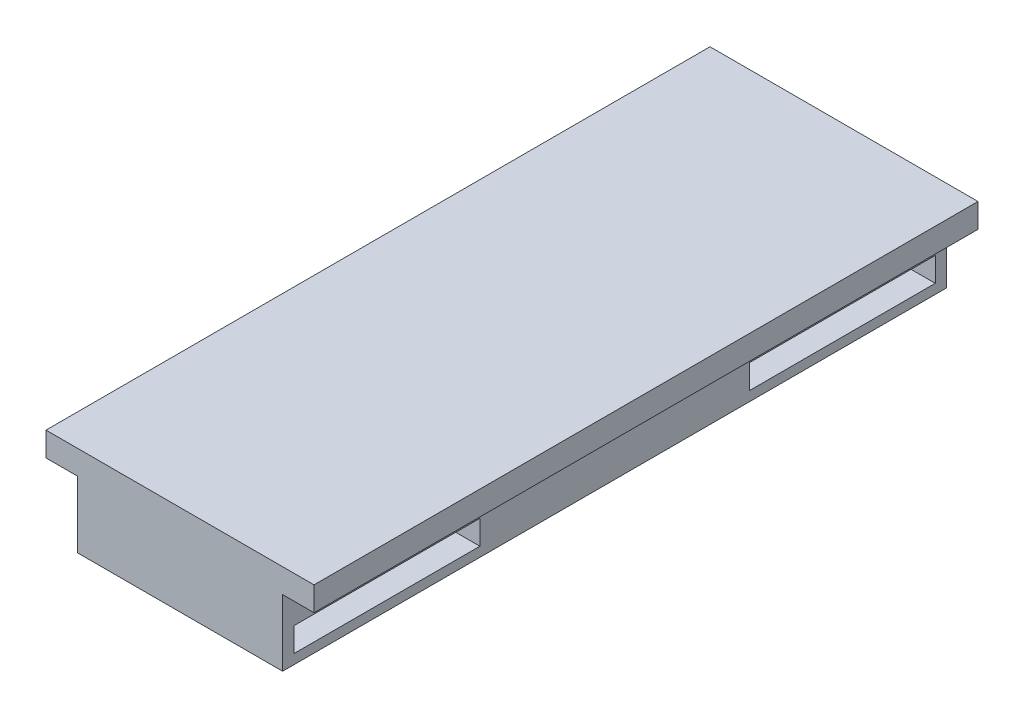
ISO-10303-21;
HEADER;
FILE_DESCRIPTION(('STEP AP214'),'2;1');
FILE_NAME('part.step','',(''),(''),'','','');
FILE_SCHEMA(('AUTOMOTIVE_DESIGN { 1 0 10303 214 1 1 1 1 }'));
ENDSEC;
DATA;
#1=APPLICATION_CONTEXT('core data for automotive mechanical design processes');
#2=APPLICATION_PROTOCOL_DEFINITION('international standard','automotive_design',2000,#1);
#3=PRODUCT_CONTEXT('',#1,'mechanical');
#4=PRODUCT('Part','Part','',(#3));
#5=PRODUCT_RELATED_PRODUCT_CATEGORY('part','',(#4));
#6=PRODUCT_DEFINITION_FORMATION('','',#4);
#7=PRODUCT_DEFINITION_CONTEXT('part definition',#1,'design');
#8=PRODUCT_DEFINITION('design','',#6,#7);
#9=PRODUCT_DEFINITION_SHAPE('','',#8);
#10=(LENGTH_UNIT() NAMED_UNIT(*) SI_UNIT(.MILLI.,.METRE.));
#11=(NAMED_UNIT(*) PLANE_ANGLE_UNIT() SI_UNIT($,.RADIAN.));
#12=(NAMED_UNIT(*) SI_UNIT($,.STERADIAN.) SOLID_ANGLE_UNIT());
#13=UNCERTAINTY_MEASURE_WITH_UNIT(LENGTH_MEASURE(1.E-05),#10,'distance_accuracy_value','');
#14=(GEOMETRIC_REPRESENTATION_CONTEXT(3) GLOBAL_UNCERTAINTY_ASSIGNED_CONTEXT((#13)) GLOBAL_UNIT_ASSIGNED_CONTEXT((#10,
#11,#12)) REPRESENTATION_CONTEXT('',''));
#15=CARTESIAN_POINT('',(0.,0.,0.));
#16=DIRECTION('',(0.,0.,1.));
#17=DIRECTION('',(1.,0.,0.));
#18=AXIS2_PLACEMENT_3D('',#15,#16,#17);
#19=CARTESIAN_POINT('',(11.1,0.519205922994457,-8.64));
#20=DIRECTION('',(0.,-1.,0.));
#21=DIRECTION('',(0.,0.,-1.));
#22=AXIS2_PLACEMENT_3D('',#19,#20,#21);
#23=CYLINDRICAL_SURFACE('',#22,7.7);
#24=DIRECTION('',(0.,-1.,0.));
#25=VECTOR('',#24,1.);
#26=CARTESIAN_POINT('',(11.1,0.519205922994459,-0.940000000000003));
#27=LINE('',#26,#25);
#28=CARTESIAN_POINT('',(11.1,0.519205922994459,-0.940000000000003));
#29=VERTEX_POINT('',#28);
#30=CARTESIAN_POINT('',(11.1,-1.48079407700554,-0.940000000000003));
#31=VERTEX_POINT('',#30);
#32=EDGE_CURVE('E154',#29,#31,#27,.T.);
#33=ORIENTED_EDGE('',*,*,#32,.T.);
#34=CARTESIAN_POINT('',(11.1,-1.48079407700554,-8.64));
#35=DIRECTION('',(0.,-1.,0.));
#36=DIRECTION('',(0.,0.,-1.));
#37=AXIS2_PLACEMENT_3D('',#34,#35,#36);
#38=CIRCLE('',#37,7.7);
#39=CARTESIAN_POINT('',(11.1,-1.48079407700554,-16.34));
#40=VERTEX_POINT('',#39);
#41=EDGE_CURVE('E48',#40,#31,#38,.F.);
#42=ORIENTED_EDGE('',*,*,#41,.F.);
#43=DIRECTION('',(0.,1.,0.));
#44=VECTOR('',#43,1.);
#45=CARTESIAN_POINT('',(11.1,0.519205922994459,-16.34));
#46=LINE('',#45,#44);
#47=CARTESIAN_POINT('',(11.1,0.519205922994457,-16.34));
#48=VERTEX_POINT('',#47);
#49=EDGE_CURVE('E162',#40,#48,#46,.T.);
#50=ORIENTED_EDGE('',*,*,#49,.T.);
#51=CARTESIAN_POINT('',(11.1,0.519205922994457,-8.64));
#52=DIRECTION('',(0.,-1.,0.));
#53=DIRECTION('',(0.,0.,-1.));
#54=AXIS2_PLACEMENT_3D('',#51,#52,#53);
#55=CIRCLE('',#54,7.7);
#56=EDGE_CURVE('E168',#29,#48,#55,.T.);
#57=ORIENTED_EDGE('',*,*,#56,.F.);
#58=EDGE_LOOP('',(#33,#42,#50,#57));
#59=FACE_BOUND('',#58,.T.);
#60=ADVANCED_FACE('F39',(#59),#23,.F.);
#61=CARTESIAN_POINT('',(11.1,0.519205922994457,-46.36));
#62=DIRECTION('',(0.,-1.,0.));
#63=DIRECTION('',(0.,0.,-1.));
#64=AXIS2_PLACEMENT_3D('',#61,#62,#63);
#65=CYLINDRICAL_SURFACE('',#64,7.7);
#66=DIRECTION('',(0.,-1.,0.));
#67=VECTOR('',#66,1.);
#68=CARTESIAN_POINT('',(11.1,0.519205922994459,-38.66));
#69=LINE('',#68,#67);
#70=CARTESIAN_POINT('',(11.1,0.519205922994459,-38.66));
#71=VERTEX_POINT('',#70);
#72=CARTESIAN_POINT('',(11.1,-1.48079407700554,-38.66));
#73=VERTEX_POINT('',#72);
#74=EDGE_CURVE('E304',#71,#73,#69,.T.);
#75=ORIENTED_EDGE('',*,*,#74,.T.);
#76=CARTESIAN_POINT('',(11.1,-1.48079407700554,-46.36));
#77=DIRECTION('',(0.,-1.,0.));
#78=DIRECTION('',(0.,0.,-1.));
#79=AXIS2_PLACEMENT_3D('',#76,#77,#78);
#80=CIRCLE('',#79,7.7);
#81=CARTESIAN_POINT('',(11.1,-1.48079407700554,-54.06));
#82=VERTEX_POINT('',#81);
#83=EDGE_CURVE('E11',#82,#73,#80,.F.);
#84=ORIENTED_EDGE('',*,*,#83,.F.);
#85=DIRECTION('',(0.,1.,0.));
#86=VECTOR('',#85,1.);
#87=CARTESIAN_POINT('',(11.1,0.519205922994459,-54.06));
#88=LINE('',#87,#86);
#89=CARTESIAN_POINT('',(11.1,0.519205922994457,-54.06));
#90=VERTEX_POINT('',#89);
#91=EDGE_CURVE('E291',#82,#90,#88,.T.);
#92=ORIENTED_EDGE('',*,*,#91,.T.);
#93=CARTESIAN_POINT('',(11.1,0.519205922994457,-46.36));
#94=DIRECTION('',(0.,-1.,0.));
#95=DIRECTION('',(0.,0.,-1.));
#96=AXIS2_PLACEMENT_3D('',#93,#94,#95);
#97=CIRCLE('',#96,7.7);
#98=EDGE_CURVE('E264',#71,#90,#97,.T.);
#99=ORIENTED_EDGE('',*,*,#98,.F.);
#100=EDGE_LOOP('',(#75,#84,#92,#99));
#101=FACE_BOUND('',#100,.T.);
#102=ADVANCED_FACE('F358',(#101),#65,.F.);
#103=CARTESIAN_POINT('',(2.6,-2.28079407700554,-55.));
#104=DIRECTION('',(-1.,0.,0.));
#105=DIRECTION('',(0.,-1.,0.));
#106=AXIS2_PLACEMENT_3D('',#103,#104,#105);
#107=PLANE('',#106);
#108=DIRECTION('',(0.,-1.,0.));
#109=VECTOR('',#108,1.);
#110=CARTESIAN_POINT('',(2.6,-2.28079407700554,0.));
#111=LINE('',#110,#109);
#112=CARTESIAN_POINT('',(2.6,3.21920592299446,0.));
#113=VERTEX_POINT('',#112);
#114=CARTESIAN_POINT('',(2.6,-2.28079407700554,0.));
#115=VERTEX_POINT('',#114);
#116=EDGE_CURVE('E230',#113,#115,#111,.T.);
#117=ORIENTED_EDGE('',*,*,#116,.F.);
#118=DIRECTION('',(0.,0.,1.));
#119=VECTOR('',#118,1.);
#120=CARTESIAN_POINT('',(2.6,3.21920592299446,-55.));
#121=LINE('',#120,#119);
#122=CARTESIAN_POINT('',(2.6,3.21920592299446,-55.));
#123=VERTEX_POINT('',#122);
#124=EDGE_CURVE('E175',#123,#113,#121,.T.);
#125=ORIENTED_EDGE('',*,*,#124,.F.);
#126=DIRECTION('',(0.,-1.,0.));
#127=VECTOR('',#126,1.);
#128=CARTESIAN_POINT('',(2.6,-2.28079407700554,-55.));
#129=LINE('',#128,#127);
#130=CARTESIAN_POINT('',(2.6,-2.28079407700554,-55.));
#131=VERTEX_POINT('',#130);
#132=EDGE_CURVE('E205',#123,#131,#129,.T.);
#133=ORIENTED_EDGE('',*,*,#132,.T.);
#134=DIRECTION('',(0.,0.,1.));
#135=VECTOR('',#134,1.);
#136=CARTESIAN_POINT('',(2.6,-2.28079407700554,-55.));
#137=LINE('',#136,#135);
#138=EDGE_CURVE('E180',#131,#115,#137,.T.);
#139=ORIENTED_EDGE('',*,*,#138,.T.);
#140=EDGE_LOOP('',(#117,#125,#133,#139));
#141=FACE_BOUND('',#140,.T.);
#142=ADVANCED_FACE('F41',(#141),#107,.T.);
#143=CARTESIAN_POINT('',(2.6,3.21920592299446,-55.));
#144=DIRECTION('',(0.,-1.,0.));
#145=DIRECTION('',(1.,0.,0.));
#146=AXIS2_PLACEMENT_3D('',#143,#144,#145);
#147=PLANE('',#146);
#148=DIRECTION('',(1.,0.,0.));
#149=VECTOR('',#148,1.);
#150=CARTESIAN_POINT('',(2.6,3.21920592299446,0.));
#151=LINE('',#150,#149);
#152=CARTESIAN_POINT('',(0.,3.21920592299446,0.));
#153=VERTEX_POINT('',#152);
#154=EDGE_CURVE('E201',#153,#113,#151,.T.);
#155=ORIENTED_EDGE('',*,*,#154,.F.);
#156=DIRECTION('',(0.,0.,1.));
#157=VECTOR('',#156,1.);
#158=CARTESIAN_POINT('',(0.,3.21920592299446,-55.));
#159=LINE('',#158,#157);
#160=CARTESIAN_POINT('',(0.,3.21920592299446,-55.));
#161=VERTEX_POINT('',#160);
#162=EDGE_CURVE('E177',#161,#153,#159,.T.);
#163=ORIENTED_EDGE('',*,*,#162,.F.);
#164=DIRECTION('',(1.,0.,0.));
#165=VECTOR('',#164,1.);
#166=CARTESIAN_POINT('',(2.6,3.21920592299446,-55.));
#167=LINE('',#166,#165);
#168=EDGE_CURVE('E184',#161,#123,#167,.T.);
#169=ORIENTED_EDGE('',*,*,#168,.T.);
#170=ORIENTED_EDGE('',*,*,#124,.T.);
#171=EDGE_LOOP('',(#155,#163,#169,#170));
#172=FACE_BOUND('',#171,.T.);
#173=ADVANCED_FACE('F383',(#172),#147,.T.);
#174=CARTESIAN_POINT('',(0.,3.21920592299446,-55.));
#175=DIRECTION('',(-1.,0.,0.));
#176=DIRECTION('',(0.,0.,1.));
#177=AXIS2_PLACEMENT_3D('',#174,#175,#176);
#178=PLANE('',#177);
#179=DIRECTION('',(0.,-1.,0.));
#180=VECTOR('',#179,1.);
#181=CARTESIAN_POINT('',(0.,3.21920592299446,0.));
#182=LINE('',#181,#180);
#183=CARTESIAN_POINT('',(0.,5.21920592299446,0.));
#184=VERTEX_POINT('',#183);
#185=EDGE_CURVE('E206',#184,#153,#182,.T.);
#186=ORIENTED_EDGE('',*,*,#185,.F.);
#187=DIRECTION('',(0.,0.,1.));
#188=VECTOR('',#187,1.);
#189=CARTESIAN_POINT('',(0.,5.21920592299446,-55.));
#190=LINE('',#189,#188);
#191=CARTESIAN_POINT('',(0.,5.21920592299446,-55.));
#192=VERTEX_POINT('',#191);
#193=EDGE_CURVE('E196',#192,#184,#190,.T.);
#194=ORIENTED_EDGE('',*,*,#193,.F.);
#195=DIRECTION('',(0.,-1.,0.));
#196=VECTOR('',#195,1.);
#197=CARTESIAN_POINT('',(0.,3.21920592299446,-55.));
#198=LINE('',#197,#196);
#199=EDGE_CURVE('E237',#192,#161,#198,.T.);
#200=ORIENTED_EDGE('',*,*,#199,.T.);
#201=ORIENTED_EDGE('',*,*,#162,.T.);
#202=EDGE_LOOP('',(#186,#194,#200,#201));
#203=FACE_BOUND('',#202,.T.);
#204=ADVANCED_FACE('F386',(#203),#178,.T.);
#205=CARTESIAN_POINT('',(0.,5.21920592299446,-55.));
#206=DIRECTION('',(0.,1.,0.));
#207=DIRECTION('',(-1.,0.,0.));
#208=AXIS2_PLACEMENT_3D('',#205,#206,#207);
#209=PLANE('',#208);
#210=DIRECTION('',(-1.,0.,0.));
#211=VECTOR('',#210,1.);
#212=CARTESIAN_POINT('',(0.,5.21920592299446,0.));
#213=LINE('',#212,#211);
#214=CARTESIAN_POINT('',(22.2,5.21920592299446,0.));
#215=VERTEX_POINT('',#214);
#216=EDGE_CURVE('E210',#215,#184,#213,.T.);
#217=ORIENTED_EDGE('',*,*,#216,.F.);
#218=DIRECTION('',(0.,0.,1.));
#219=VECTOR('',#218,1.);
#220=CARTESIAN_POINT('',(22.2,5.21920592299446,-55.));
#221=LINE('',#220,#219);
#222=CARTESIAN_POINT('',(22.2,5.21920592299446,-55.));
#223=VERTEX_POINT('',#222);
#224=EDGE_CURVE('E193',#223,#215,#221,.T.);
#225=ORIENTED_EDGE('',*,*,#224,.F.);
#226=DIRECTION('',(-1.,0.,0.));
#227=VECTOR('',#226,1.);
#228=CARTESIAN_POINT('',(0.,5.21920592299446,-55.));
#229=LINE('',#228,#227);
#230=EDGE_CURVE('E241',#223,#192,#229,.T.);
#231=ORIENTED_EDGE('',*,*,#230,.T.);
#232=ORIENTED_EDGE('',*,*,#193,.T.);
#233=EDGE_LOOP('',(#217,#225,#231,#232));
#234=FACE_BOUND('',#233,.T.);
#235=ADVANCED_FACE('F390',(#234),#209,.T.);
#236=CARTESIAN_POINT('',(22.2,5.21920592299446,-55.));
#237=DIRECTION('',(1.,0.,0.));
#238=DIRECTION('',(0.,0.,-1.));
#239=AXIS2_PLACEMENT_3D('',#236,#237,#238);
#240=PLANE('',#239);
#241=DIRECTION('',(0.,1.,0.));
#242=VECTOR('',#241,1.);
#243=CARTESIAN_POINT('',(22.2,5.21920592299446,0.));
#244=LINE('',#243,#242);
#245=CARTESIAN_POINT('',(22.2,3.21920592299446,0.));
#246=VERTEX_POINT('',#245);
#247=EDGE_CURVE('E214',#246,#215,#244,.T.);
#248=ORIENTED_EDGE('',*,*,#247,.F.);
#249=DIRECTION('',(0.,0.,1.));
#250=VECTOR('',#249,1.);
#251=CARTESIAN_POINT('',(22.2,3.21920592299446,-55.));
#252=LINE('',#251,#250);
#253=CARTESIAN_POINT('',(22.2,3.21920592299446,-55.));
#254=VERTEX_POINT('',#253);
#255=EDGE_CURVE('E190',#254,#246,#252,.T.);
#256=ORIENTED_EDGE('',*,*,#255,.F.);
#257=DIRECTION('',(0.,1.,0.));
#258=VECTOR('',#257,1.);
#259=CARTESIAN_POINT('',(22.2,5.21920592299446,-55.));
#260=LINE('',#259,#258);
#261=EDGE_CURVE('E245',#254,#223,#260,.T.);
#262=ORIENTED_EDGE('',*,*,#261,.T.);
#263=ORIENTED_EDGE('',*,*,#224,.T.);
#264=EDGE_LOOP('',(#248,#256,#262,#263));
#265=FACE_BOUND('',#264,.T.);
#266=ADVANCED_FACE('F394',(#265),#240,.T.);
#267=CARTESIAN_POINT('',(22.2,3.21920592299446,-55.));
#268=DIRECTION('',(0.,-1.,0.));
#269=DIRECTION('',(1.,0.,0.));
#270=AXIS2_PLACEMENT_3D('',#267,#268,#269);
#271=PLANE('',#270);
#272=DIRECTION('',(1.,0.,0.));
#273=VECTOR('',#272,1.);
#274=CARTESIAN_POINT('',(22.2,3.21920592299446,0.));
#275=LINE('',#274,#273);
#276=CARTESIAN_POINT('',(19.6,3.21920592299446,0.));
#277=VERTEX_POINT('',#276);
#278=EDGE_CURVE('E218',#277,#246,#275,.T.);
#279=ORIENTED_EDGE('',*,*,#278,.F.);
#280=DIRECTION('',(0.,0.,1.));
#281=VECTOR('',#280,1.);
#282=CARTESIAN_POINT('',(19.6,3.21920592299446,-55.));
#283=LINE('',#282,#281);
#284=CARTESIAN_POINT('',(19.6,3.21920592299446,-55.));
#285=VERTEX_POINT('',#284);
#286=EDGE_CURVE('E187',#285,#277,#283,.T.);
#287=ORIENTED_EDGE('',*,*,#286,.F.);
#288=DIRECTION('',(1.,0.,0.));
#289=VECTOR('',#288,1.);
#290=CARTESIAN_POINT('',(22.2,3.21920592299446,-55.));
#291=LINE('',#290,#289);
#292=EDGE_CURVE('E249',#285,#254,#291,.T.);
#293=ORIENTED_EDGE('',*,*,#292,.T.);
#294=ORIENTED_EDGE('',*,*,#255,.T.);
#295=EDGE_LOOP('',(#279,#287,#293,#294));
#296=FACE_BOUND('',#295,.T.);
#297=ADVANCED_FACE('F398',(#296),#271,.T.);
#298=CARTESIAN_POINT('',(19.6,-2.28079407700554,-55.));
#299=DIRECTION('',(1.,0.,0.));
#300=DIRECTION('',(0.,0.,-1.));
#301=AXIS2_PLACEMENT_3D('',#298,#299,#300);
#302=PLANE('',#301);
#303=DIRECTION('',(0.,-1.,0.));
#304=VECTOR('',#303,1.);
#305=CARTESIAN_POINT('',(19.6,0.519205922994459,-0.940000000000003));
#306=LINE('',#305,#304);
#307=CARTESIAN_POINT('',(19.6,0.519205922994459,-0.940000000000003));
#308=VERTEX_POINT('',#307);
#309=CARTESIAN_POINT('',(19.6,-1.48079407700554,-0.940000000000003));
#310=VERTEX_POINT('',#309);
#311=EDGE_CURVE('E55',#308,#310,#306,.T.);
#312=ORIENTED_EDGE('',*,*,#311,.F.);
#313=DIRECTION('',(0.,0.,1.));
#314=VECTOR('',#313,1.);
#315=CARTESIAN_POINT('',(19.6,0.519205922994459,-0.940000000000003));
#316=LINE('',#315,#314);
#317=CARTESIAN_POINT('',(19.6,0.519205922994459,-16.34));
#318=VERTEX_POINT('',#317);
#319=EDGE_CURVE('E170',#318,#308,#316,.T.);
#320=ORIENTED_EDGE('',*,*,#319,.F.);
#321=DIRECTION('',(0.,1.,0.));
#322=VECTOR('',#321,1.);
#323=CARTESIAN_POINT('',(19.6,0.519205922994459,-16.34));
#324=LINE('',#323,#322);
#325=CARTESIAN_POINT('',(19.6,-1.48079407700554,-16.34));
#326=VERTEX_POINT('',#325);
#327=EDGE_CURVE('E331',#326,#318,#324,.T.);
#328=ORIENTED_EDGE('',*,*,#327,.F.);
#329=DIRECTION('',(0.,0.,-1.));
#330=VECTOR('',#329,1.);
#331=CARTESIAN_POINT('',(19.6,-1.48079407700554,-0.940000000000003));
#332=LINE('',#331,#330);
#333=EDGE_CURVE('E335',#310,#326,#332,.T.);
#334=ORIENTED_EDGE('',*,*,#333,.F.);
#335=EDGE_LOOP('',(#312,#320,#328,#334));
#336=FACE_BOUND('',#335,.T.);
#337=DIRECTION('',(0.,-1.,0.));
#338=VECTOR('',#337,1.);
#339=CARTESIAN_POINT('',(19.6,0.519205922994459,-38.66));
#340=LINE('',#339,#338);
#341=CARTESIAN_POINT('',(19.6,0.519205922994459,-38.66));
#342=VERTEX_POINT('',#341);
#343=CARTESIAN_POINT('',(19.6,-1.48079407700554,-38.66));
#344=VERTEX_POINT('',#343);
#345=EDGE_CURVE('E63',#342,#344,#340,.T.);
#346=ORIENTED_EDGE('',*,*,#345,.F.);
#347=DIRECTION('',(0.,0.,1.));
#348=VECTOR('',#347,1.);
#349=CARTESIAN_POINT('',(19.6,0.519205922994459,-38.66));
#350=LINE('',#349,#348);
#351=CARTESIAN_POINT('',(19.6,0.519205922994459,-54.06));
#352=VERTEX_POINT('',#351);
#353=EDGE_CURVE('E300',#352,#342,#350,.T.);
#354=ORIENTED_EDGE('',*,*,#353,.F.);
#355=DIRECTION('',(0.,1.,0.));
#356=VECTOR('',#355,1.);
#357=CARTESIAN_POINT('',(19.6,0.519205922994459,-54.06));
#358=LINE('',#357,#356);
#359=CARTESIAN_POINT('',(19.6,-1.48079407700554,-54.06));
#360=VERTEX_POINT('',#359);
#361=EDGE_CURVE('E305',#360,#352,#358,.T.);
#362=ORIENTED_EDGE('',*,*,#361,.F.);
#363=DIRECTION('',(0.,0.,-1.));
#364=VECTOR('',#363,1.);
#365=CARTESIAN_POINT('',(19.6,-1.48079407700554,-38.66));
#366=LINE('',#365,#364);
#367=EDGE_CURVE('E309',#344,#360,#366,.T.);
#368=ORIENTED_EDGE('',*,*,#367,.F.);
#369=EDGE_LOOP('',(#346,#354,#362,#368));
#370=FACE_BOUND('',#369,.T.);
#371=DIRECTION('',(0.,1.,0.));
#372=VECTOR('',#371,1.);
#373=CARTESIAN_POINT('',(19.6,-2.28079407700554,0.));
#374=LINE('',#373,#372);
#375=CARTESIAN_POINT('',(19.6,-2.28079407700554,0.));
#376=VERTEX_POINT('',#375);
#377=EDGE_CURVE('E222',#376,#277,#374,.T.);
#378=ORIENTED_EDGE('',*,*,#377,.F.);
#379=DIRECTION('',(0.,0.,1.));
#380=VECTOR('',#379,1.);
#381=CARTESIAN_POINT('',(19.6,-2.28079407700554,-55.));
#382=LINE('',#381,#380);
#383=CARTESIAN_POINT('',(19.6,-2.28079407700554,-55.));
#384=VERTEX_POINT('',#383);
#385=EDGE_CURVE('E183',#384,#376,#382,.T.);
#386=ORIENTED_EDGE('',*,*,#385,.F.);
#387=DIRECTION('',(0.,1.,0.));
#388=VECTOR('',#387,1.);
#389=CARTESIAN_POINT('',(19.6,-2.28079407700554,-55.));
#390=LINE('',#389,#388);
#391=EDGE_CURVE('E253',#384,#285,#390,.T.);
#392=ORIENTED_EDGE('',*,*,#391,.T.);
#393=ORIENTED_EDGE('',*,*,#286,.T.);
#394=EDGE_LOOP('',(#378,#386,#392,#393));
#395=FACE_BOUND('',#394,.T.);
#396=ADVANCED_FACE('F347',(#336,#370,#395),#302,.T.);
#397=CARTESIAN_POINT('',(2.6,-2.28079407700554,-55.));
#398=DIRECTION('',(0.,-1.,0.));
#399=DIRECTION('',(1.,0.,0.));
#400=AXIS2_PLACEMENT_3D('',#397,#398,#399);
#401=PLANE('',#400);
#402=DIRECTION('',(1.,0.,0.));
#403=VECTOR('',#402,1.);
#404=CARTESIAN_POINT('',(2.6,-2.28079407700554,0.));
#405=LINE('',#404,#403);
#406=EDGE_CURVE('E226',#115,#376,#405,.T.);
#407=ORIENTED_EDGE('',*,*,#406,.F.);
#408=ORIENTED_EDGE('',*,*,#138,.F.);
#409=DIRECTION('',(1.,0.,0.));
#410=VECTOR('',#409,1.);
#411=CARTESIAN_POINT('',(2.6,-2.28079407700554,-55.));
#412=LINE('',#411,#410);
#413=EDGE_CURVE('E257',#131,#384,#412,.T.);
#414=ORIENTED_EDGE('',*,*,#413,.T.);
#415=ORIENTED_EDGE('',*,*,#385,.T.);
#416=EDGE_LOOP('',(#407,#408,#414,#415));
#417=FACE_BOUND('',#416,.T.);
#418=CARTESIAN_POINT('',(11.1,-2.28079407700554,-8.64));
#419=DIRECTION('',(0.,-1.,0.));
#420=DIRECTION('',(0.,0.,-1.));
#421=AXIS2_PLACEMENT_3D('',#418,#419,#420);
#422=CIRCLE('',#421,5.5);
#423=CARTESIAN_POINT('',(11.1,-2.28079407700554,-14.14));
#424=VERTEX_POINT('',#423);
#425=EDGE_CURVE('E271',#424,#424,#422,.T.);
#426=ORIENTED_EDGE('',*,*,#425,.F.);
#427=EDGE_LOOP('',(#426));
#428=FACE_BOUND('',#427,.T.);
#429=CARTESIAN_POINT('',(11.1,-2.28079407700554,-46.36));
#430=DIRECTION('',(0.,-1.,0.));
#431=DIRECTION('',(0.,0.,-1.));
#432=AXIS2_PLACEMENT_3D('',#429,#430,#431);
#433=CIRCLE('',#432,5.5);
#434=CARTESIAN_POINT('',(11.1,-2.28079407700554,-51.86));
#435=VERTEX_POINT('',#434);
#436=EDGE_CURVE('E279',#435,#435,#433,.T.);
#437=ORIENTED_EDGE('',*,*,#436,.F.);
#438=EDGE_LOOP('',(#437));
#439=FACE_BOUND('',#438,.T.);
#440=ADVANCED_FACE('F378',(#417,#428,#439),#401,.T.);
#441=CARTESIAN_POINT('',(0.,0.,-55.));
#442=DIRECTION('',(0.,0.,1.));
#443=DIRECTION('',(1.,0.,0.));
#444=AXIS2_PLACEMENT_3D('',#441,#442,#443);
#445=PLANE('',#444);
#446=ORIENTED_EDGE('',*,*,#132,.F.);
#447=ORIENTED_EDGE('',*,*,#168,.F.);
#448=ORIENTED_EDGE('',*,*,#199,.F.);
#449=ORIENTED_EDGE('',*,*,#230,.F.);
#450=ORIENTED_EDGE('',*,*,#261,.F.);
#451=ORIENTED_EDGE('',*,*,#292,.F.);
#452=ORIENTED_EDGE('',*,*,#391,.F.);
#453=ORIENTED_EDGE('',*,*,#413,.F.);
#454=EDGE_LOOP('',(#446,#447,#448,#449,#450,#451,#452,#453));
#455=FACE_BOUND('',#454,.T.);
#456=ADVANCED_FACE('F374',(#455),#445,.F.);
#457=CARTESIAN_POINT('',(0.,0.,0.));
#458=DIRECTION('',(0.,0.,1.));
#459=DIRECTION('',(1.,0.,0.));
#460=AXIS2_PLACEMENT_3D('',#457,#458,#459);
#461=PLANE('',#460);
#462=ORIENTED_EDGE('',*,*,#116,.T.);
#463=ORIENTED_EDGE('',*,*,#406,.T.);
#464=ORIENTED_EDGE('',*,*,#377,.T.);
#465=ORIENTED_EDGE('',*,*,#278,.T.);
#466=ORIENTED_EDGE('',*,*,#247,.T.);
#467=ORIENTED_EDGE('',*,*,#216,.T.);
#468=ORIENTED_EDGE('',*,*,#185,.T.);
#469=ORIENTED_EDGE('',*,*,#154,.T.);
#470=EDGE_LOOP('',(#462,#463,#464,#465,#466,#467,#468,#469));
#471=FACE_BOUND('',#470,.T.);
#472=ADVANCED_FACE('F377',(#471),#461,.T.);
#473=CARTESIAN_POINT('',(11.1,-1.48079407700554,-8.64));
#474=DIRECTION('',(0.,-1.,0.));
#475=DIRECTION('',(0.,0.,-1.));
#476=AXIS2_PLACEMENT_3D('',#473,#474,#475);
#477=PLANE('',#476);
#478=CARTESIAN_POINT('',(11.1,-1.48079407700554,-8.64));
#479=DIRECTION('',(0.,-1.,0.));
#480=DIRECTION('',(0.,0.,-1.));
#481=AXIS2_PLACEMENT_3D('',#478,#479,#480);
#482=CIRCLE('',#481,5.5);
#483=CARTESIAN_POINT('',(11.1,-1.48079407700554,-14.14));
#484=VERTEX_POINT('',#483);
#485=EDGE_CURVE('E268',#484,#484,#482,.T.);
#486=ORIENTED_EDGE('',*,*,#485,.T.);
#487=EDGE_LOOP('',(#486));
#488=FACE_BOUND('',#487,.T.);
#489=DIRECTION('',(1.,0.,0.));
#490=VECTOR('',#489,1.);
#491=CARTESIAN_POINT('',(11.1,-1.48079407700554,-16.34));
#492=LINE('',#491,#490);
#493=EDGE_CURVE('E161',#40,#326,#492,.T.);
#494=ORIENTED_EDGE('',*,*,#493,.F.);
#495=ORIENTED_EDGE('',*,*,#41,.T.);
#496=DIRECTION('',(1.,0.,0.));
#497=VECTOR('',#496,1.);
#498=CARTESIAN_POINT('',(11.1,-1.48079407700554,-0.940000000000003));
#499=LINE('',#498,#497);
#500=EDGE_CURVE('E151',#31,#310,#499,.T.);
#501=ORIENTED_EDGE('',*,*,#500,.T.);
#502=ORIENTED_EDGE('',*,*,#333,.T.);
#503=EDGE_LOOP('',(#494,#495,#501,#502));
#504=FACE_BOUND('',#503,.T.);
#505=ADVANCED_FACE('F172',(#488,#504),#477,.F.);
#506=CARTESIAN_POINT('',(11.1,-1.48079407700554,-8.64));
#507=DIRECTION('',(0.,-1.,0.));
#508=DIRECTION('',(0.,0.,-1.));
#509=AXIS2_PLACEMENT_3D('',#506,#507,#508);
#510=CYLINDRICAL_SURFACE('',#509,5.5);
#511=ORIENTED_EDGE('',*,*,#485,.F.);
#512=EDGE_LOOP('',(#511));
#513=FACE_BOUND('',#512,.T.);
#514=ORIENTED_EDGE('',*,*,#425,.T.);
#515=EDGE_LOOP('',(#514));
#516=FACE_BOUND('',#515,.T.);
#517=ADVANCED_FACE('F427',(#513,#516),#510,.F.);
#518=CARTESIAN_POINT('',(11.1,0.519205922994457,-8.64));
#519=DIRECTION('',(0.,-1.,0.));
#520=DIRECTION('',(0.,0.,-1.));
#521=AXIS2_PLACEMENT_3D('',#518,#519,#520);
#522=PLANE('',#521);
#523=DIRECTION('',(1.,0.,0.));
#524=VECTOR('',#523,1.);
#525=CARTESIAN_POINT('',(11.1,0.519205922994459,-0.940000000000003));
#526=LINE('',#525,#524);
#527=EDGE_CURVE('E283',#29,#308,#526,.T.);
#528=ORIENTED_EDGE('',*,*,#527,.F.);
#529=ORIENTED_EDGE('',*,*,#56,.T.);
#530=DIRECTION('',(1.,0.,0.));
#531=VECTOR('',#530,1.);
#532=CARTESIAN_POINT('',(11.1,0.519205922994459,-16.34));
#533=LINE('',#532,#531);
#534=EDGE_CURVE('E323',#48,#318,#533,.T.);
#535=ORIENTED_EDGE('',*,*,#534,.T.);
#536=ORIENTED_EDGE('',*,*,#319,.T.);
#537=EDGE_LOOP('',(#528,#529,#535,#536));
#538=FACE_BOUND('',#537,.T.);
#539=ADVANCED_FACE('F343',(#538),#522,.T.);
#540=CARTESIAN_POINT('',(11.1,-1.48079407700554,-46.36));
#541=DIRECTION('',(0.,-1.,0.));
#542=DIRECTION('',(0.,0.,-1.));
#543=AXIS2_PLACEMENT_3D('',#540,#541,#542);
#544=PLANE('',#543);
#545=CARTESIAN_POINT('',(11.1,-1.48079407700554,-46.36));
#546=DIRECTION('',(0.,-1.,0.));
#547=DIRECTION('',(0.,0.,-1.));
#548=AXIS2_PLACEMENT_3D('',#545,#546,#547);
#549=CIRCLE('',#548,5.5);
#550=CARTESIAN_POINT('',(11.1,-1.48079407700554,-51.86));
#551=VERTEX_POINT('',#550);
#552=EDGE_CURVE('E275',#551,#551,#549,.T.);
#553=ORIENTED_EDGE('',*,*,#552,.T.);
#554=EDGE_LOOP('',(#553));
#555=FACE_BOUND('',#554,.T.);
#556=DIRECTION('',(1.,0.,0.));
#557=VECTOR('',#556,1.);
#558=CARTESIAN_POINT('',(11.1,-1.48079407700554,-54.06));
#559=LINE('',#558,#557);
#560=EDGE_CURVE('E290',#82,#360,#559,.T.);
#561=ORIENTED_EDGE('',*,*,#560,.F.);
#562=ORIENTED_EDGE('',*,*,#83,.T.);
#563=DIRECTION('',(1.,0.,0.));
#564=VECTOR('',#563,1.);
#565=CARTESIAN_POINT('',(11.1,-1.48079407700554,-38.66));
#566=LINE('',#565,#564);
#567=EDGE_CURVE('E287',#73,#344,#566,.T.);
#568=ORIENTED_EDGE('',*,*,#567,.T.);
#569=ORIENTED_EDGE('',*,*,#367,.T.);
#570=EDGE_LOOP('',(#561,#562,#568,#569));
#571=FACE_BOUND('',#570,.T.);
#572=ADVANCED_FACE('F415',(#555,#571),#544,.F.);
#573=CARTESIAN_POINT('',(11.1,-1.48079407700554,-46.36));
#574=DIRECTION('',(0.,-1.,0.));
#575=DIRECTION('',(0.,0.,-1.));
#576=AXIS2_PLACEMENT_3D('',#573,#574,#575);
#577=CYLINDRICAL_SURFACE('',#576,5.5);
#578=ORIENTED_EDGE('',*,*,#552,.F.);
#579=EDGE_LOOP('',(#578));
#580=FACE_BOUND('',#579,.T.);
#581=ORIENTED_EDGE('',*,*,#436,.T.);
#582=EDGE_LOOP('',(#581));
#583=FACE_BOUND('',#582,.T.);
#584=ADVANCED_FACE('F371',(#580,#583),#577,.F.);
#585=CARTESIAN_POINT('',(11.1,0.519205922994457,-46.36));
#586=DIRECTION('',(0.,-1.,0.));
#587=DIRECTION('',(0.,0.,-1.));
#588=AXIS2_PLACEMENT_3D('',#585,#586,#587);
#589=PLANE('',#588);
#590=DIRECTION('',(1.,0.,0.));
#591=VECTOR('',#590,1.);
#592=CARTESIAN_POINT('',(11.1,0.519205922994459,-38.66));
#593=LINE('',#592,#591);
#594=EDGE_CURVE('E297',#71,#342,#593,.T.);
#595=ORIENTED_EDGE('',*,*,#594,.F.);
#596=ORIENTED_EDGE('',*,*,#98,.T.);
#597=DIRECTION('',(1.,0.,0.));
#598=VECTOR('',#597,1.);
#599=CARTESIAN_POINT('',(11.1,0.519205922994459,-54.06));
#600=LINE('',#599,#598);
#601=EDGE_CURVE('E294',#90,#352,#600,.T.);
#602=ORIENTED_EDGE('',*,*,#601,.T.);
#603=ORIENTED_EDGE('',*,*,#353,.T.);
#604=EDGE_LOOP('',(#595,#596,#602,#603));
#605=FACE_BOUND('',#604,.T.);
#606=ADVANCED_FACE('F368',(#605),#589,.T.);
#607=CARTESIAN_POINT('',(11.1,0.519205922994459,-38.66));
#608=DIRECTION('',(0.,0.,1.));
#609=DIRECTION('',(1.,0.,0.));
#610=AXIS2_PLACEMENT_3D('',#607,#608,#609);
#611=PLANE('',#610);
#612=ORIENTED_EDGE('',*,*,#345,.T.);
#613=ORIENTED_EDGE('',*,*,#567,.F.);
#614=ORIENTED_EDGE('',*,*,#74,.F.);
#615=ORIENTED_EDGE('',*,*,#594,.T.);
#616=EDGE_LOOP('',(#612,#613,#614,#615));
#617=FACE_BOUND('',#616,.T.);
#618=ADVANCED_FACE('F370',(#617),#611,.F.);
#619=CARTESIAN_POINT('',(11.1,0.519205922994459,-54.06));
#620=DIRECTION('',(0.,0.,-1.));
#621=DIRECTION('',(-1.,0.,0.));
#622=AXIS2_PLACEMENT_3D('',#619,#620,#621);
#623=PLANE('',#622);
#624=ORIENTED_EDGE('',*,*,#361,.T.);
#625=ORIENTED_EDGE('',*,*,#601,.F.);
#626=ORIENTED_EDGE('',*,*,#91,.F.);
#627=ORIENTED_EDGE('',*,*,#560,.T.);
#628=EDGE_LOOP('',(#624,#625,#626,#627));
#629=FACE_BOUND('',#628,.T.);
#630=ADVANCED_FACE('F355',(#629),#623,.F.);
#631=CARTESIAN_POINT('',(11.1,0.519205922994459,-0.940000000000003));
#632=DIRECTION('',(0.,0.,1.));
#633=DIRECTION('',(0.,-1.,0.));
#634=AXIS2_PLACEMENT_3D('',#631,#632,#633);
#635=PLANE('',#634);
#636=ORIENTED_EDGE('',*,*,#311,.T.);
#637=ORIENTED_EDGE('',*,*,#500,.F.);
#638=ORIENTED_EDGE('',*,*,#32,.F.);
#639=ORIENTED_EDGE('',*,*,#527,.T.);
#640=EDGE_LOOP('',(#636,#637,#638,#639));
#641=FACE_BOUND('',#640,.T.);
#642=ADVANCED_FACE('F153',(#641),#635,.F.);
#643=CARTESIAN_POINT('',(11.1,0.519205922994459,-16.34));
#644=DIRECTION('',(0.,0.,-1.));
#645=DIRECTION('',(-1.,0.,0.));
#646=AXIS2_PLACEMENT_3D('',#643,#644,#645);
#647=PLANE('',#646);
#648=ORIENTED_EDGE('',*,*,#327,.T.);
#649=ORIENTED_EDGE('',*,*,#534,.F.);
#650=ORIENTED_EDGE('',*,*,#49,.F.);
#651=ORIENTED_EDGE('',*,*,#493,.T.);
#652=EDGE_LOOP('',(#648,#649,#650,#651));
#653=FACE_BOUND('',#652,.T.);
#654=ADVANCED_FACE('F349',(#653),#647,.F.);
#655=CLOSED_SHELL('',(#60,#102,#142,#173,#204,#235,#266,#297,#396,#440,#456,#472,#505,#517,#539,
#572,#584,#606,#618,#630,#642,#654));
#656=MANIFOLD_SOLID_BREP('B2',#655);
#657=ADVANCED_BREP_SHAPE_REPRESENTATION('',(#18,#656),#14);
#658=SHAPE_DEFINITION_REPRESENTATION(#9,#657);
ENDSEC;
END-ISO-10303-21;
